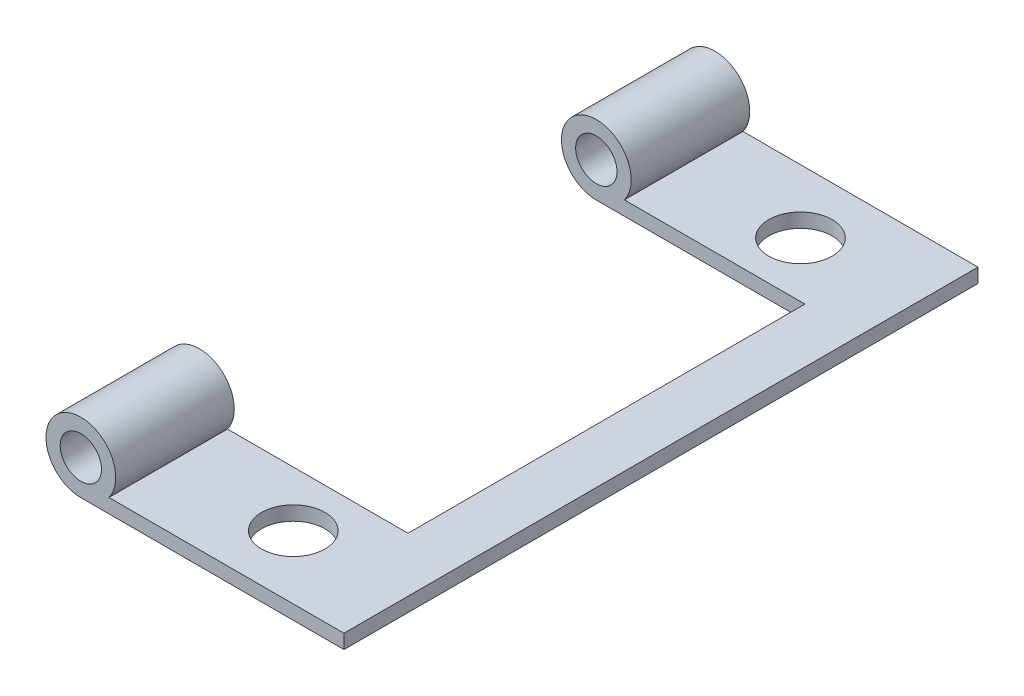
ISO-10303-21;
HEADER;
FILE_DESCRIPTION(('STEP AP214'),'2;1');
FILE_NAME('part.step','',(''),(''),'','','');
FILE_SCHEMA(('AUTOMOTIVE_DESIGN { 1 0 10303 214 1 1 1 1 }'));
ENDSEC;
DATA;
#1=APPLICATION_CONTEXT('core data for automotive mechanical design processes');
#2=APPLICATION_PROTOCOL_DEFINITION('international standard','automotive_design',2000,#1);
#3=PRODUCT_CONTEXT('',#1,'mechanical');
#4=PRODUCT('Part','Part','',(#3));
#5=PRODUCT_RELATED_PRODUCT_CATEGORY('part','',(#4));
#6=PRODUCT_DEFINITION_FORMATION('','',#4);
#7=PRODUCT_DEFINITION_CONTEXT('part definition',#1,'design');
#8=PRODUCT_DEFINITION('design','',#6,#7);
#9=PRODUCT_DEFINITION_SHAPE('','',#8);
#10=(LENGTH_UNIT() NAMED_UNIT(*) SI_UNIT(.MILLI.,.METRE.));
#11=(NAMED_UNIT(*) PLANE_ANGLE_UNIT() SI_UNIT($,.RADIAN.));
#12=(NAMED_UNIT(*) SI_UNIT($,.STERADIAN.) SOLID_ANGLE_UNIT());
#13=UNCERTAINTY_MEASURE_WITH_UNIT(LENGTH_MEASURE(1.E-05),#10,'distance_accuracy_value','');
#14=(GEOMETRIC_REPRESENTATION_CONTEXT(3) GLOBAL_UNCERTAINTY_ASSIGNED_CONTEXT((#13)) GLOBAL_UNIT_ASSIGNED_CONTEXT((#10,
#11,#12)) REPRESENTATION_CONTEXT('',''));
#15=CARTESIAN_POINT('',(0.,0.,0.));
#16=DIRECTION('',(0.,0.,1.));
#17=DIRECTION('',(1.,0.,0.));
#18=AXIS2_PLACEMENT_3D('',#15,#16,#17);
#19=CARTESIAN_POINT('',(0.,1.12,0.));
#20=DIRECTION('',(0.,1.,0.));
#21=DIRECTION('',(0.,0.,1.));
#22=AXIS2_PLACEMENT_3D('',#19,#20,#21);
#23=PLANE('',#22);
#24=CARTESIAN_POINT('',(0.,1.12,-20.));
#25=DIRECTION('',(0.,1.,0.));
#26=DIRECTION('',(0.,0.,1.));
#27=AXIS2_PLACEMENT_3D('',#24,#25,#26);
#28=CIRCLE('',#27,2.5);
#29=CARTESIAN_POINT('',(0.,1.12,-17.5));
#30=VERTEX_POINT('',#29);
#31=EDGE_CURVE('E146',#30,#30,#28,.T.);
#32=ORIENTED_EDGE('',*,*,#31,.F.);
#33=EDGE_LOOP('',(#32));
#34=FACE_BOUND('',#33,.T.);
#35=CARTESIAN_POINT('',(0.,1.12,20.));
#36=DIRECTION('',(0.,1.,0.));
#37=DIRECTION('',(0.,0.,1.));
#38=AXIS2_PLACEMENT_3D('',#35,#36,#37);
#39=CIRCLE('',#38,2.5);
#40=CARTESIAN_POINT('',(0.,1.12,22.5));
#41=VERTEX_POINT('',#40);
#42=EDGE_CURVE('E139',#41,#41,#39,.T.);
#43=ORIENTED_EDGE('',*,*,#42,.F.);
#44=EDGE_LOOP('',(#43));
#45=FACE_BOUND('',#44,.T.);
#46=DIRECTION('',(0.,0.,-1.));
#47=VECTOR('',#46,1.);
#48=CARTESIAN_POINT('',(-9.53514108801487,1.12,-7.87182540694798));
#49=LINE('',#48,#47);
#50=CARTESIAN_POINT('',(-9.53514108801486,1.12,-15.65));
#51=VERTEX_POINT('',#50);
#52=CARTESIAN_POINT('',(-9.53514108801485,1.12,-25.));
#53=VERTEX_POINT('',#52);
#54=EDGE_CURVE('E132',#51,#53,#49,.T.);
#55=ORIENTED_EDGE('',*,*,#54,.F.);
#56=DIRECTION('',(1.,0.,0.));
#57=VECTOR('',#56,1.);
#58=CARTESIAN_POINT('',(-9.,1.12,-15.65));
#59=LINE('',#58,#57);
#60=CARTESIAN_POINT('',(4.7,1.12,-15.65));
#61=VERTEX_POINT('',#60);
#62=EDGE_CURVE('E155',#51,#61,#59,.T.);
#63=ORIENTED_EDGE('',*,*,#62,.T.);
#64=DIRECTION('',(0.,0.,1.));
#65=VECTOR('',#64,1.);
#66=CARTESIAN_POINT('',(4.7,1.12,-15.65));
#67=LINE('',#66,#65);
#68=CARTESIAN_POINT('',(4.7,1.12,15.65));
#69=VERTEX_POINT('',#68);
#70=EDGE_CURVE('E157',#61,#69,#67,.T.);
#71=ORIENTED_EDGE('',*,*,#70,.T.);
#72=DIRECTION('',(-1.,0.,0.));
#73=VECTOR('',#72,1.);
#74=CARTESIAN_POINT('',(-9.,1.12,15.65));
#75=LINE('',#74,#73);
#76=CARTESIAN_POINT('',(-9.53514108801485,1.12,15.65));
#77=VERTEX_POINT('',#76);
#78=EDGE_CURVE('E159',#69,#77,#75,.T.);
#79=ORIENTED_EDGE('',*,*,#78,.T.);
#80=CARTESIAN_POINT('',(-9.53514108801485,1.12,25.));
#81=VERTEX_POINT('',#80);
#82=EDGE_CURVE('E116',#81,#77,#49,.T.);
#83=ORIENTED_EDGE('',*,*,#82,.F.);
#84=DIRECTION('',(1.,0.,0.));
#85=VECTOR('',#84,1.);
#86=CARTESIAN_POINT('',(-9.00000000000002,1.12,25.));
#87=LINE('',#86,#85);
#88=CARTESIAN_POINT('',(9.00000000000004,1.12,25.));
#89=VERTEX_POINT('',#88);
#90=EDGE_CURVE('E51',#81,#89,#87,.T.);
#91=ORIENTED_EDGE('',*,*,#90,.T.);
#92=DIRECTION('',(0.,0.,-1.));
#93=VECTOR('',#92,1.);
#94=CARTESIAN_POINT('',(9.00000000000001,1.12,-25.));
#95=LINE('',#94,#93);
#96=CARTESIAN_POINT('',(9.00000000000001,1.12,-25.));
#97=VERTEX_POINT('',#96);
#98=EDGE_CURVE('E152',#89,#97,#95,.T.);
#99=ORIENTED_EDGE('',*,*,#98,.T.);
#100=DIRECTION('',(-1.,0.,0.));
#101=VECTOR('',#100,1.);
#102=CARTESIAN_POINT('',(-8.99999999999999,1.12,-25.));
#103=LINE('',#102,#101);
#104=EDGE_CURVE('E84',#97,#53,#103,.T.);
#105=ORIENTED_EDGE('',*,*,#104,.T.);
#106=EDGE_LOOP('',(#55,#63,#71,#79,#83,#91,#99,#105));
#107=FACE_BOUND('',#106,.T.);
#108=ADVANCED_FACE('F34',(#34,#45,#107),#23,.T.);
#109=CARTESIAN_POINT('',(0.,0.,0.));
#110=DIRECTION('',(0.,1.,0.));
#111=DIRECTION('',(0.,0.,1.));
#112=AXIS2_PLACEMENT_3D('',#109,#110,#111);
#113=PLANE('',#112);
#114=CARTESIAN_POINT('',(0.,0.,20.));
#115=DIRECTION('',(0.,1.,0.));
#116=DIRECTION('',(0.,0.,1.));
#117=AXIS2_PLACEMENT_3D('',#114,#115,#116);
#118=CIRCLE('',#117,2.5);
#119=CARTESIAN_POINT('',(0.,0.,22.5));
#120=VERTEX_POINT('',#119);
#121=EDGE_CURVE('E143',#120,#120,#118,.T.);
#122=ORIENTED_EDGE('',*,*,#121,.T.);
#123=EDGE_LOOP('',(#122));
#124=FACE_BOUND('',#123,.T.);
#125=CARTESIAN_POINT('',(0.,0.,-20.));
#126=DIRECTION('',(0.,1.,0.));
#127=DIRECTION('',(0.,0.,1.));
#128=AXIS2_PLACEMENT_3D('',#125,#126,#127);
#129=CIRCLE('',#128,2.5);
#130=CARTESIAN_POINT('',(0.,0.,-17.5));
#131=VERTEX_POINT('',#130);
#132=EDGE_CURVE('E142',#131,#131,#129,.T.);
#133=ORIENTED_EDGE('',*,*,#132,.T.);
#134=EDGE_LOOP('',(#133));
#135=FACE_BOUND('',#134,.T.);
#136=DIRECTION('',(1.,0.,0.));
#137=VECTOR('',#136,1.);
#138=CARTESIAN_POINT('',(-9.,0.,-15.65));
#139=LINE('',#138,#137);
#140=CARTESIAN_POINT('',(-11.75,0.,-15.65));
#141=VERTEX_POINT('',#140);
#142=CARTESIAN_POINT('',(4.7,0.,-15.65));
#143=VERTEX_POINT('',#142);
#144=EDGE_CURVE('E168',#141,#143,#139,.T.);
#145=ORIENTED_EDGE('',*,*,#144,.F.);
#146=DIRECTION('',(0.,0.,-1.));
#147=VECTOR('',#146,1.);
#148=CARTESIAN_POINT('',(-11.75,0.,-7.87182540694799));
#149=LINE('',#148,#147);
#150=CARTESIAN_POINT('',(-11.75,0.,-25.));
#151=VERTEX_POINT('',#150);
#152=EDGE_CURVE('E133',#141,#151,#149,.T.);
#153=ORIENTED_EDGE('',*,*,#152,.T.);
#154=DIRECTION('',(-1.,0.,0.));
#155=VECTOR('',#154,1.);
#156=CARTESIAN_POINT('',(-8.99999999999999,0.,-25.));
#157=LINE('',#156,#155);
#158=CARTESIAN_POINT('',(9.00000000000001,0.,-25.));
#159=VERTEX_POINT('',#158);
#160=EDGE_CURVE('E165',#159,#151,#157,.T.);
#161=ORIENTED_EDGE('',*,*,#160,.F.);
#162=DIRECTION('',(0.,0.,-1.));
#163=VECTOR('',#162,1.);
#164=CARTESIAN_POINT('',(9.00000000000001,0.,-25.));
#165=LINE('',#164,#163);
#166=CARTESIAN_POINT('',(9.00000000000004,0.,25.));
#167=VERTEX_POINT('',#166);
#168=EDGE_CURVE('E149',#167,#159,#165,.T.);
#169=ORIENTED_EDGE('',*,*,#168,.F.);
#170=DIRECTION('',(1.,0.,0.));
#171=VECTOR('',#170,1.);
#172=CARTESIAN_POINT('',(-9.00000000000002,0.,25.));
#173=LINE('',#172,#171);
#174=CARTESIAN_POINT('',(-11.75,0.,25.));
#175=VERTEX_POINT('',#174);
#176=EDGE_CURVE('E77',#175,#167,#173,.T.);
#177=ORIENTED_EDGE('',*,*,#176,.F.);
#178=CARTESIAN_POINT('',(-11.75,0.,15.65));
#179=VERTEX_POINT('',#178);
#180=EDGE_CURVE('E115',#175,#179,#149,.T.);
#181=ORIENTED_EDGE('',*,*,#180,.T.);
#182=DIRECTION('',(-1.,0.,0.));
#183=VECTOR('',#182,1.);
#184=CARTESIAN_POINT('',(-9.,0.,15.65));
#185=LINE('',#184,#183);
#186=CARTESIAN_POINT('',(4.7,0.,15.65));
#187=VERTEX_POINT('',#186);
#188=EDGE_CURVE('E123',#187,#179,#185,.T.);
#189=ORIENTED_EDGE('',*,*,#188,.F.);
#190=DIRECTION('',(0.,0.,1.));
#191=VECTOR('',#190,1.);
#192=CARTESIAN_POINT('',(4.7,0.,-15.65));
#193=LINE('',#192,#191);
#194=EDGE_CURVE('E70',#143,#187,#193,.T.);
#195=ORIENTED_EDGE('',*,*,#194,.F.);
#196=EDGE_LOOP('',(#145,#153,#161,#169,#177,#181,#189,#195));
#197=FACE_BOUND('',#196,.T.);
#198=ADVANCED_FACE('F130',(#124,#135,#197),#113,.F.);
#199=CARTESIAN_POINT('',(-11.75,2.75,-7.87182540694799));
#200=DIRECTION('',(0.,0.,-1.));
#201=DIRECTION('',(-1.,0.,0.));
#202=AXIS2_PLACEMENT_3D('',#199,#200,#201);
#203=CYLINDRICAL_SURFACE('',#202,2.75);
#204=ORIENTED_EDGE('',*,*,#152,.F.);
#205=CARTESIAN_POINT('',(-11.75,2.75,-15.65));
#206=DIRECTION('',(0.,0.,1.));
#207=DIRECTION('',(1.,0.,0.));
#208=AXIS2_PLACEMENT_3D('',#205,#206,#207);
#209=CIRCLE('',#208,2.75);
#210=EDGE_CURVE('E182',#141,#51,#209,.F.);
#211=ORIENTED_EDGE('',*,*,#210,.T.);
#212=ORIENTED_EDGE('',*,*,#54,.T.);
#213=CARTESIAN_POINT('',(-11.75,2.75,-25.));
#214=DIRECTION('',(0.,0.,-1.));
#215=DIRECTION('',(-1.,0.,0.));
#216=AXIS2_PLACEMENT_3D('',#213,#214,#215);
#217=CIRCLE('',#216,2.75);
#218=EDGE_CURVE('E136',#151,#53,#217,.T.);
#219=ORIENTED_EDGE('',*,*,#218,.F.);
#220=EDGE_LOOP('',(#204,#211,#212,#219));
#221=FACE_BOUND('',#220,.T.);
#222=ADVANCED_FACE('F181',(#221),#203,.T.);
#223=ORIENTED_EDGE('',*,*,#82,.T.);
#224=CARTESIAN_POINT('',(-11.75,2.75,15.65));
#225=DIRECTION('',(0.,0.,-1.));
#226=DIRECTION('',(-1.,0.,0.));
#227=AXIS2_PLACEMENT_3D('',#224,#225,#226);
#228=CIRCLE('',#227,2.75);
#229=EDGE_CURVE('E110',#77,#179,#228,.F.);
#230=ORIENTED_EDGE('',*,*,#229,.T.);
#231=ORIENTED_EDGE('',*,*,#180,.F.);
#232=CARTESIAN_POINT('',(-11.75,2.75,25.));
#233=DIRECTION('',(0.,0.,-1.));
#234=DIRECTION('',(-1.,0.,0.));
#235=AXIS2_PLACEMENT_3D('',#232,#233,#234);
#236=CIRCLE('',#235,2.75);
#237=EDGE_CURVE('E186',#175,#81,#236,.T.);
#238=ORIENTED_EDGE('',*,*,#237,.T.);
#239=EDGE_LOOP('',(#223,#230,#231,#238));
#240=FACE_BOUND('',#239,.T.);
#241=ADVANCED_FACE('F112',(#240),#203,.T.);
#242=CARTESIAN_POINT('',(-11.75,2.75,-7.87182540694799));
#243=DIRECTION('',(0.,0.,-1.));
#244=DIRECTION('',(-1.,0.,0.));
#245=AXIS2_PLACEMENT_3D('',#242,#243,#244);
#246=CYLINDRICAL_SURFACE('',#245,1.63);
#247=CARTESIAN_POINT('',(-11.75,2.75,-25.));
#248=DIRECTION('',(0.,0.,-1.));
#249=DIRECTION('',(-1.,0.,0.));
#250=AXIS2_PLACEMENT_3D('',#247,#248,#249);
#251=CIRCLE('',#250,1.63);
#252=CARTESIAN_POINT('',(-13.38,2.75,-25.));
#253=VERTEX_POINT('',#252);
#254=EDGE_CURVE('E184',#253,#253,#251,.T.);
#255=ORIENTED_EDGE('',*,*,#254,.T.);
#256=EDGE_LOOP('',(#255));
#257=FACE_BOUND('',#256,.T.);
#258=CARTESIAN_POINT('',(-11.75,2.75,-15.65));
#259=DIRECTION('',(0.,0.,1.));
#260=DIRECTION('',(1.,0.,0.));
#261=AXIS2_PLACEMENT_3D('',#258,#259,#260);
#262=CIRCLE('',#261,1.63);
#263=CARTESIAN_POINT('',(-10.12,2.75,-15.65));
#264=VERTEX_POINT('',#263);
#265=EDGE_CURVE('E194',#264,#264,#262,.F.);
#266=ORIENTED_EDGE('',*,*,#265,.F.);
#267=EDGE_LOOP('',(#266));
#268=FACE_BOUND('',#267,.T.);
#269=ADVANCED_FACE('F203',(#257,#268),#246,.F.);
#270=CARTESIAN_POINT('',(-11.75,2.75,25.));
#271=DIRECTION('',(0.,0.,-1.));
#272=DIRECTION('',(-1.,0.,0.));
#273=AXIS2_PLACEMENT_3D('',#270,#271,#272);
#274=CIRCLE('',#273,1.63);
#275=CARTESIAN_POINT('',(-13.38,2.75,25.));
#276=VERTEX_POINT('',#275);
#277=EDGE_CURVE('E190',#276,#276,#274,.T.);
#278=ORIENTED_EDGE('',*,*,#277,.F.);
#279=EDGE_LOOP('',(#278));
#280=FACE_BOUND('',#279,.T.);
#281=CARTESIAN_POINT('',(-11.75,2.75,15.65));
#282=DIRECTION('',(0.,0.,-1.));
#283=DIRECTION('',(-1.,0.,0.));
#284=AXIS2_PLACEMENT_3D('',#281,#282,#283);
#285=CIRCLE('',#284,1.63);
#286=CARTESIAN_POINT('',(-13.38,2.75,15.65));
#287=VERTEX_POINT('',#286);
#288=EDGE_CURVE('E120',#287,#287,#285,.F.);
#289=ORIENTED_EDGE('',*,*,#288,.F.);
#290=EDGE_LOOP('',(#289));
#291=FACE_BOUND('',#290,.T.);
#292=ADVANCED_FACE('F200',(#280,#291),#246,.F.);
#293=CARTESIAN_POINT('',(-9.,1.12,-15.65));
#294=DIRECTION('',(0.,0.,-1.));
#295=DIRECTION('',(-1.,0.,0.));
#296=AXIS2_PLACEMENT_3D('',#293,#294,#295);
#297=PLANE('',#296);
#298=ORIENTED_EDGE('',*,*,#62,.F.);
#299=ORIENTED_EDGE('',*,*,#210,.F.);
#300=ORIENTED_EDGE('',*,*,#144,.T.);
#301=DIRECTION('',(0.,-1.,0.));
#302=VECTOR('',#301,1.);
#303=CARTESIAN_POINT('',(4.7,1.12,-15.65));
#304=LINE('',#303,#302);
#305=EDGE_CURVE('E43',#61,#143,#304,.T.);
#306=ORIENTED_EDGE('',*,*,#305,.F.);
#307=EDGE_LOOP('',(#298,#299,#300,#306));
#308=FACE_BOUND('',#307,.T.);
#309=ORIENTED_EDGE('',*,*,#265,.T.);
#310=EDGE_LOOP('',(#309));
#311=FACE_BOUND('',#310,.T.);
#312=ADVANCED_FACE('F202',(#308,#311),#297,.F.);
#313=CARTESIAN_POINT('',(9.00000000000001,1.12,-25.));
#314=DIRECTION('',(-1.,0.,0.));
#315=DIRECTION('',(0.,0.,1.));
#316=AXIS2_PLACEMENT_3D('',#313,#314,#315);
#317=PLANE('',#316);
#318=ORIENTED_EDGE('',*,*,#168,.T.);
#319=DIRECTION('',(0.,-1.,0.));
#320=VECTOR('',#319,1.);
#321=CARTESIAN_POINT('',(9.00000000000001,1.12,-25.));
#322=LINE('',#321,#320);
#323=EDGE_CURVE('E11',#97,#159,#322,.T.);
#324=ORIENTED_EDGE('',*,*,#323,.F.);
#325=ORIENTED_EDGE('',*,*,#98,.F.);
#326=DIRECTION('',(0.,-1.,0.));
#327=VECTOR('',#326,1.);
#328=CARTESIAN_POINT('',(9.00000000000004,1.12,25.));
#329=LINE('',#328,#327);
#330=EDGE_CURVE('E162',#89,#167,#329,.T.);
#331=ORIENTED_EDGE('',*,*,#330,.T.);
#332=EDGE_LOOP('',(#318,#324,#325,#331));
#333=FACE_BOUND('',#332,.T.);
#334=ADVANCED_FACE('F36',(#333),#317,.F.);
#335=CARTESIAN_POINT('',(-8.99999999999999,1.12,-25.));
#336=DIRECTION('',(0.,0.,1.));
#337=DIRECTION('',(1.,0.,0.));
#338=AXIS2_PLACEMENT_3D('',#335,#336,#337);
#339=PLANE('',#338);
#340=ORIENTED_EDGE('',*,*,#160,.T.);
#341=ORIENTED_EDGE('',*,*,#218,.T.);
#342=ORIENTED_EDGE('',*,*,#104,.F.);
#343=ORIENTED_EDGE('',*,*,#323,.T.);
#344=EDGE_LOOP('',(#340,#341,#342,#343));
#345=FACE_BOUND('',#344,.T.);
#346=ORIENTED_EDGE('',*,*,#254,.F.);
#347=EDGE_LOOP('',(#346));
#348=FACE_BOUND('',#347,.T.);
#349=ADVANCED_FACE('F234',(#345,#348),#339,.F.);
#350=CARTESIAN_POINT('',(4.7,1.12,-15.65));
#351=DIRECTION('',(1.,0.,0.));
#352=DIRECTION('',(0.,0.,-1.));
#353=AXIS2_PLACEMENT_3D('',#350,#351,#352);
#354=PLANE('',#353);
#355=ORIENTED_EDGE('',*,*,#194,.T.);
#356=DIRECTION('',(0.,-1.,0.));
#357=VECTOR('',#356,1.);
#358=CARTESIAN_POINT('',(4.7,1.12,15.65));
#359=LINE('',#358,#357);
#360=EDGE_CURVE('E126',#69,#187,#359,.T.);
#361=ORIENTED_EDGE('',*,*,#360,.F.);
#362=ORIENTED_EDGE('',*,*,#70,.F.);
#363=ORIENTED_EDGE('',*,*,#305,.T.);
#364=EDGE_LOOP('',(#355,#361,#362,#363));
#365=FACE_BOUND('',#364,.T.);
#366=ADVANCED_FACE('F175',(#365),#354,.F.);
#367=CARTESIAN_POINT('',(-9.,1.12,15.65));
#368=DIRECTION('',(0.,0.,1.));
#369=DIRECTION('',(1.,0.,0.));
#370=AXIS2_PLACEMENT_3D('',#367,#368,#369);
#371=PLANE('',#370);
#372=ORIENTED_EDGE('',*,*,#188,.T.);
#373=ORIENTED_EDGE('',*,*,#229,.F.);
#374=ORIENTED_EDGE('',*,*,#78,.F.);
#375=ORIENTED_EDGE('',*,*,#360,.T.);
#376=EDGE_LOOP('',(#372,#373,#374,#375));
#377=FACE_BOUND('',#376,.T.);
#378=ORIENTED_EDGE('',*,*,#288,.T.);
#379=EDGE_LOOP('',(#378));
#380=FACE_BOUND('',#379,.T.);
#381=ADVANCED_FACE('F124',(#377,#380),#371,.F.);
#382=CARTESIAN_POINT('',(-9.00000000000002,1.12,25.));
#383=DIRECTION('',(0.,0.,-1.));
#384=DIRECTION('',(-1.,0.,0.));
#385=AXIS2_PLACEMENT_3D('',#382,#383,#384);
#386=PLANE('',#385);
#387=ORIENTED_EDGE('',*,*,#176,.T.);
#388=ORIENTED_EDGE('',*,*,#330,.F.);
#389=ORIENTED_EDGE('',*,*,#90,.F.);
#390=ORIENTED_EDGE('',*,*,#237,.F.);
#391=EDGE_LOOP('',(#387,#388,#389,#390));
#392=FACE_BOUND('',#391,.T.);
#393=ORIENTED_EDGE('',*,*,#277,.T.);
#394=EDGE_LOOP('',(#393));
#395=FACE_BOUND('',#394,.T.);
#396=ADVANCED_FACE('F228',(#392,#395),#386,.F.);
#397=CARTESIAN_POINT('',(0.,1.12,-20.));
#398=DIRECTION('',(0.,-1.,0.));
#399=DIRECTION('',(0.,0.,-1.));
#400=AXIS2_PLACEMENT_3D('',#397,#398,#399);
#401=CYLINDRICAL_SURFACE('',#400,2.5);
#402=ORIENTED_EDGE('',*,*,#31,.T.);
#403=EDGE_LOOP('',(#402));
#404=FACE_BOUND('',#403,.T.);
#405=ORIENTED_EDGE('',*,*,#132,.F.);
#406=EDGE_LOOP('',(#405));
#407=FACE_BOUND('',#406,.T.);
#408=ADVANCED_FACE('F225',(#404,#407),#401,.F.);
#409=CARTESIAN_POINT('',(0.,1.12,20.));
#410=DIRECTION('',(0.,-1.,0.));
#411=DIRECTION('',(0.,0.,-1.));
#412=AXIS2_PLACEMENT_3D('',#409,#410,#411);
#413=CYLINDRICAL_SURFACE('',#412,2.5);
#414=ORIENTED_EDGE('',*,*,#42,.T.);
#415=EDGE_LOOP('',(#414));
#416=FACE_BOUND('',#415,.T.);
#417=ORIENTED_EDGE('',*,*,#121,.F.);
#418=EDGE_LOOP('',(#417));
#419=FACE_BOUND('',#418,.T.);
#420=ADVANCED_FACE('F280',(#416,#419),#413,.F.);
#421=CLOSED_SHELL('',(#108,#198,#222,#241,#269,#292,#312,#334,#349,#366,#381,#396,#408,#420));
#422=MANIFOLD_SOLID_BREP('B2',#421);
#423=ADVANCED_BREP_SHAPE_REPRESENTATION('',(#18,#422),#14);
#424=SHAPE_DEFINITION_REPRESENTATION(#9,#423);
ENDSEC;
END-ISO-10303-21;
